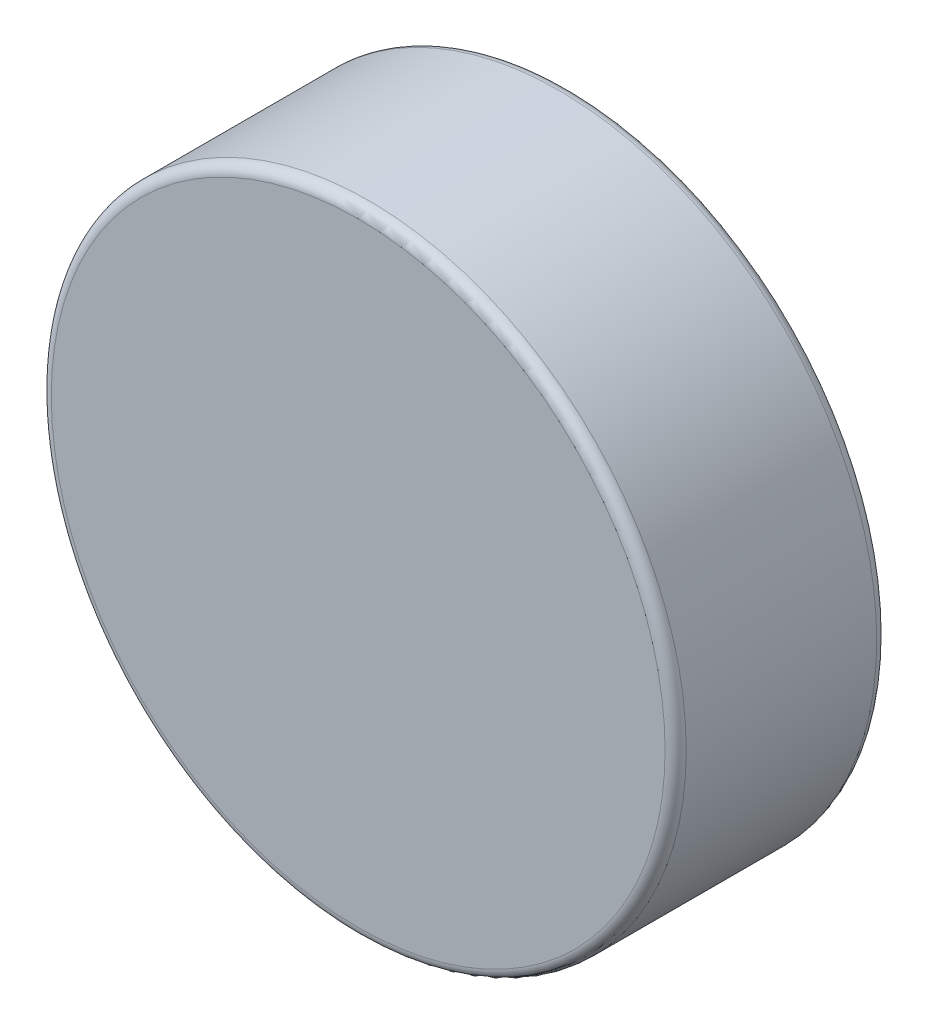
ISO-10303-21;
HEADER;
FILE_DESCRIPTION(('STEP AP214'),'2;1');
FILE_NAME('part.step','',(''),(''),'','','');
FILE_SCHEMA(('AUTOMOTIVE_DESIGN { 1 0 10303 214 1 1 1 1 }'));
ENDSEC;
DATA;
#1=APPLICATION_CONTEXT('core data for automotive mechanical design processes');
#2=APPLICATION_PROTOCOL_DEFINITION('international standard','automotive_design',2000,#1);
#3=PRODUCT_CONTEXT('',#1,'mechanical');
#4=PRODUCT('Part','Part','',(#3));
#5=PRODUCT_RELATED_PRODUCT_CATEGORY('part','',(#4));
#6=PRODUCT_DEFINITION_FORMATION('','',#4);
#7=PRODUCT_DEFINITION_CONTEXT('part definition',#1,'design');
#8=PRODUCT_DEFINITION('design','',#6,#7);
#9=PRODUCT_DEFINITION_SHAPE('','',#8);
#10=(LENGTH_UNIT() NAMED_UNIT(*) SI_UNIT(.MILLI.,.METRE.));
#11=(NAMED_UNIT(*) PLANE_ANGLE_UNIT() SI_UNIT($,.RADIAN.));
#12=(NAMED_UNIT(*) SI_UNIT($,.STERADIAN.) SOLID_ANGLE_UNIT());
#13=UNCERTAINTY_MEASURE_WITH_UNIT(LENGTH_MEASURE(1.E-05),#10,'distance_accuracy_value','');
#14=(GEOMETRIC_REPRESENTATION_CONTEXT(3) GLOBAL_UNCERTAINTY_ASSIGNED_CONTEXT((#13)) GLOBAL_UNIT_ASSIGNED_CONTEXT((#10,
#11,#12)) REPRESENTATION_CONTEXT('',''));
#15=CARTESIAN_POINT('',(0.,0.,0.));
#16=DIRECTION('',(0.,0.,1.));
#17=DIRECTION('',(1.,0.,0.));
#18=AXIS2_PLACEMENT_3D('',#15,#16,#17);
#19=CARTESIAN_POINT('',(0.,0.,25.4));
#20=DIRECTION('',(0.,0.,-1.));
#21=DIRECTION('',(-1.,0.,0.));
#22=AXIS2_PLACEMENT_3D('',#19,#20,#21);
#23=CYLINDRICAL_SURFACE('',#22,38.1);
#24=CARTESIAN_POINT('',(0.,0.,1.27));
#25=DIRECTION('',(0.,0.,1.));
#26=DIRECTION('',(1.,0.,0.));
#27=AXIS2_PLACEMENT_3D('',#24,#25,#26);
#28=CIRCLE('',#27,38.1);
#29=CARTESIAN_POINT('',(38.1,0.,1.27));
#30=VERTEX_POINT('',#29);
#31=EDGE_CURVE('E41',#30,#30,#28,.T.);
#32=ORIENTED_EDGE('',*,*,#31,.T.);
#33=EDGE_LOOP('',(#32));
#34=FACE_BOUND('',#33,.T.);
#35=CARTESIAN_POINT('',(0.,0.,24.13));
#36=DIRECTION('',(0.,0.,1.));
#37=DIRECTION('',(1.,0.,0.));
#38=AXIS2_PLACEMENT_3D('',#35,#36,#37);
#39=CIRCLE('',#38,38.1);
#40=CARTESIAN_POINT('',(38.1,0.,24.13));
#41=VERTEX_POINT('',#40);
#42=EDGE_CURVE('E45',#41,#41,#39,.F.);
#43=ORIENTED_EDGE('',*,*,#42,.T.);
#44=EDGE_LOOP('',(#43));
#45=FACE_BOUND('',#44,.T.);
#46=ADVANCED_FACE('F30',(#34,#45),#23,.T.);
#47=CARTESIAN_POINT('',(0.,0.,25.4));
#48=DIRECTION('',(0.,0.,1.));
#49=DIRECTION('',(1.,0.,0.));
#50=AXIS2_PLACEMENT_3D('',#47,#48,#49);
#51=PLANE('',#50);
#52=CARTESIAN_POINT('',(0.,0.,25.4));
#53=DIRECTION('',(0.,0.,1.));
#54=DIRECTION('',(1.,0.,0.));
#55=AXIS2_PLACEMENT_3D('',#52,#53,#54);
#56=CIRCLE('',#55,36.83);
#57=CARTESIAN_POINT('',(36.83,0.,25.4));
#58=VERTEX_POINT('',#57);
#59=EDGE_CURVE('E10',#58,#58,#56,.T.);
#60=ORIENTED_EDGE('',*,*,#59,.T.);
#61=EDGE_LOOP('',(#60));
#62=FACE_BOUND('',#61,.T.);
#63=ADVANCED_FACE('F61',(#62),#51,.T.);
#64=CARTESIAN_POINT('',(0.,0.,0.));
#65=DIRECTION('',(0.,0.,1.));
#66=DIRECTION('',(1.,0.,0.));
#67=AXIS2_PLACEMENT_3D('',#64,#65,#66);
#68=PLANE('',#67);
#69=CARTESIAN_POINT('',(0.,0.,0.));
#70=DIRECTION('',(0.,0.,1.));
#71=DIRECTION('',(1.,0.,0.));
#72=AXIS2_PLACEMENT_3D('',#69,#70,#71);
#73=CIRCLE('',#72,36.83);
#74=CARTESIAN_POINT('',(36.83,0.,0.));
#75=VERTEX_POINT('',#74);
#76=EDGE_CURVE('E37',#75,#75,#73,.F.);
#77=ORIENTED_EDGE('',*,*,#76,.T.);
#78=EDGE_LOOP('',(#77));
#79=FACE_BOUND('',#78,.T.);
#80=ADVANCED_FACE('F58',(#79),#68,.F.);
#81=CARTESIAN_POINT('',(0.,0.,1.27));
#82=DIRECTION('',(0.,0.,1.));
#83=DIRECTION('',(1.,0.,0.));
#84=AXIS2_PLACEMENT_3D('',#81,#82,#83);
#85=TOROIDAL_SURFACE('',#84,36.83,1.27);
#86=ORIENTED_EDGE('',*,*,#76,.F.);
#87=EDGE_LOOP('',(#86));
#88=FACE_BOUND('',#87,.T.);
#89=ORIENTED_EDGE('',*,*,#31,.F.);
#90=EDGE_LOOP('',(#89));
#91=FACE_BOUND('',#90,.T.);
#92=ADVANCED_FACE('F54',(#88,#91),#85,.T.);
#93=CARTESIAN_POINT('',(0.,0.,24.13));
#94=DIRECTION('',(0.,0.,1.));
#95=DIRECTION('',(1.,0.,0.));
#96=AXIS2_PLACEMENT_3D('',#93,#94,#95);
#97=TOROIDAL_SURFACE('',#96,36.83,1.27);
#98=ORIENTED_EDGE('',*,*,#42,.F.);
#99=EDGE_LOOP('',(#98));
#100=FACE_BOUND('',#99,.T.);
#101=ORIENTED_EDGE('',*,*,#59,.F.);
#102=EDGE_LOOP('',(#101));
#103=FACE_BOUND('',#102,.T.);
#104=ADVANCED_FACE('F32',(#100,#103),#97,.T.);
#105=CLOSED_SHELL('',(#46,#63,#80,#92,#104));
#106=MANIFOLD_SOLID_BREP('B2',#105);
#107=ADVANCED_BREP_SHAPE_REPRESENTATION('',(#18,#106),#14);
#108=SHAPE_DEFINITION_REPRESENTATION(#9,#107);
ENDSEC;
END-ISO-10303-21;
